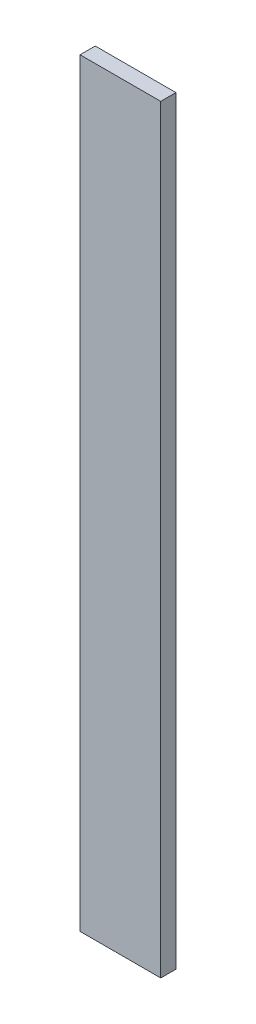
ISO-10303-21;
HEADER;
FILE_DESCRIPTION(('STEP AP214'),'2;1');
FILE_NAME('part.step','',(''),(''),'','','');
FILE_SCHEMA(('AUTOMOTIVE_DESIGN { 1 0 10303 214 1 1 1 1 }'));
ENDSEC;
DATA;
#1=APPLICATION_CONTEXT('core data for automotive mechanical design processes');
#2=APPLICATION_PROTOCOL_DEFINITION('international standard','automotive_design',2000,#1);
#3=PRODUCT_CONTEXT('',#1,'mechanical');
#4=PRODUCT('Part','Part','',(#3));
#5=PRODUCT_RELATED_PRODUCT_CATEGORY('part','',(#4));
#6=PRODUCT_DEFINITION_FORMATION('','',#4);
#7=PRODUCT_DEFINITION_CONTEXT('part definition',#1,'design');
#8=PRODUCT_DEFINITION('design','',#6,#7);
#9=PRODUCT_DEFINITION_SHAPE('','',#8);
#10=(LENGTH_UNIT() NAMED_UNIT(*) SI_UNIT(.MILLI.,.METRE.));
#11=(NAMED_UNIT(*) PLANE_ANGLE_UNIT() SI_UNIT($,.RADIAN.));
#12=(NAMED_UNIT(*) SI_UNIT($,.STERADIAN.) SOLID_ANGLE_UNIT());
#13=UNCERTAINTY_MEASURE_WITH_UNIT(LENGTH_MEASURE(1.E-05),#10,'distance_accuracy_value','');
#14=(GEOMETRIC_REPRESENTATION_CONTEXT(3) GLOBAL_UNCERTAINTY_ASSIGNED_CONTEXT((#13)) GLOBAL_UNIT_ASSIGNED_CONTEXT((#10,
#11,#12)) REPRESENTATION_CONTEXT('',''));
#15=CARTESIAN_POINT('',(0.,0.,0.));
#16=DIRECTION('',(0.,0.,1.));
#17=DIRECTION('',(1.,0.,0.));
#18=AXIS2_PLACEMENT_3D('',#15,#16,#17);
#19=CARTESIAN_POINT('',(184.303499260173,142.200586634191,5.9));
#20=DIRECTION('',(0.,0.,1.));
#21=DIRECTION('',(1.,0.,0.));
#22=AXIS2_PLACEMENT_3D('',#19,#20,#21);
#23=PLANE('',#22);
#24=DIRECTION('',(1.,0.,0.));
#25=VECTOR('',#24,1.);
#26=CARTESIAN_POINT('',(184.303499260173,147.200586634191,5.9));
#27=LINE('',#26,#25);
#28=CARTESIAN_POINT('',(184.834749260173,147.200586634191,5.9));
#29=VERTEX_POINT('',#28);
#30=CARTESIAN_POINT('',(184.303499260173,147.200586634191,5.9));
#31=VERTEX_POINT('',#30);
#32=EDGE_CURVE('E20',#29,#31,#27,.F.);
#33=ORIENTED_EDGE('',*,*,#32,.F.);
#34=DIRECTION('',(0.,1.,0.));
#35=VECTOR('',#34,1.);
#36=CARTESIAN_POINT('',(184.834749260173,142.200586634191,5.9));
#37=LINE('',#36,#35);
#38=CARTESIAN_POINT('',(184.834749260173,142.200586634191,5.9));
#39=VERTEX_POINT('',#38);
#40=EDGE_CURVE('E69',#29,#39,#37,.F.);
#41=ORIENTED_EDGE('',*,*,#40,.T.);
#42=DIRECTION('',(1.,0.,0.));
#43=VECTOR('',#42,1.);
#44=CARTESIAN_POINT('',(184.303499260173,142.200586634191,5.9));
#45=LINE('',#44,#43);
#46=CARTESIAN_POINT('',(184.303499260173,142.200586634191,5.9));
#47=VERTEX_POINT('',#46);
#48=EDGE_CURVE('E56',#39,#47,#45,.F.);
#49=ORIENTED_EDGE('',*,*,#48,.T.);
#50=DIRECTION('',(0.,1.,0.));
#51=VECTOR('',#50,1.);
#52=CARTESIAN_POINT('',(184.303499260173,147.200586634191,5.9));
#53=LINE('',#52,#51);
#54=EDGE_CURVE('E62',#47,#31,#53,.T.);
#55=ORIENTED_EDGE('',*,*,#54,.T.);
#56=EDGE_LOOP('',(#33,#41,#49,#55));
#57=FACE_BOUND('',#56,.T.);
#58=ADVANCED_FACE('F17',(#57),#23,.F.);
#59=CARTESIAN_POINT('',(184.303499260173,147.200586634191,6.));
#60=DIRECTION('',(1.,0.,0.));
#61=DIRECTION('',(0.,0.,-1.));
#62=AXIS2_PLACEMENT_3D('',#59,#60,#61);
#63=PLANE('',#62);
#64=DIRECTION('',(0.,0.,1.));
#65=VECTOR('',#64,1.);
#66=CARTESIAN_POINT('',(184.303499260173,142.200586634191,6.));
#67=LINE('',#66,#65);
#68=CARTESIAN_POINT('',(184.303499260173,142.200586634191,6.));
#69=VERTEX_POINT('',#68);
#70=EDGE_CURVE('E64',#47,#69,#67,.T.);
#71=ORIENTED_EDGE('',*,*,#70,.T.);
#72=DIRECTION('',(0.,1.,0.));
#73=VECTOR('',#72,1.);
#74=CARTESIAN_POINT('',(184.303499260173,142.200586634191,6.));
#75=LINE('',#74,#73);
#76=CARTESIAN_POINT('',(184.303499260173,147.200586634191,6.));
#77=VERTEX_POINT('',#76);
#78=EDGE_CURVE('E83',#77,#69,#75,.F.);
#79=ORIENTED_EDGE('',*,*,#78,.F.);
#80=DIRECTION('',(0.,0.,-1.));
#81=VECTOR('',#80,1.);
#82=CARTESIAN_POINT('',(184.303499260173,147.200586634191,6.));
#83=LINE('',#82,#81);
#84=EDGE_CURVE('E67',#77,#31,#83,.T.);
#85=ORIENTED_EDGE('',*,*,#84,.T.);
#86=ORIENTED_EDGE('',*,*,#54,.F.);
#87=EDGE_LOOP('',(#71,#79,#85,#86));
#88=FACE_BOUND('',#87,.T.);
#89=ADVANCED_FACE('F63',(#88),#63,.F.);
#90=CARTESIAN_POINT('',(184.303499260173,142.200586634191,6.));
#91=DIRECTION('',(0.,1.,0.));
#92=DIRECTION('',(0.,0.,1.));
#93=AXIS2_PLACEMENT_3D('',#90,#91,#92);
#94=PLANE('',#93);
#95=DIRECTION('',(0.,0.,1.));
#96=VECTOR('',#95,1.);
#97=CARTESIAN_POINT('',(184.834749260173,142.200586634191,6.));
#98=LINE('',#97,#96);
#99=CARTESIAN_POINT('',(184.834749260173,142.200586634191,6.));
#100=VERTEX_POINT('',#99);
#101=EDGE_CURVE('E71',#39,#100,#98,.T.);
#102=ORIENTED_EDGE('',*,*,#101,.T.);
#103=DIRECTION('',(1.,0.,0.));
#104=VECTOR('',#103,1.);
#105=CARTESIAN_POINT('',(184.303499260173,142.200586634191,6.));
#106=LINE('',#105,#104);
#107=EDGE_CURVE('E75',#69,#100,#106,.T.);
#108=ORIENTED_EDGE('',*,*,#107,.F.);
#109=ORIENTED_EDGE('',*,*,#70,.F.);
#110=ORIENTED_EDGE('',*,*,#48,.F.);
#111=EDGE_LOOP('',(#102,#108,#109,#110));
#112=FACE_BOUND('',#111,.T.);
#113=ADVANCED_FACE('F73',(#112),#94,.F.);
#114=CARTESIAN_POINT('',(184.834749260173,142.200586634191,6.));
#115=DIRECTION('',(-1.,0.,0.));
#116=DIRECTION('',(0.,0.,1.));
#117=AXIS2_PLACEMENT_3D('',#114,#115,#116);
#118=PLANE('',#117);
#119=DIRECTION('',(0.,0.,-1.));
#120=VECTOR('',#119,1.);
#121=CARTESIAN_POINT('',(184.834749260173,147.200586634191,6.));
#122=LINE('',#121,#120);
#123=CARTESIAN_POINT('',(184.834749260173,147.200586634191,6.));
#124=VERTEX_POINT('',#123);
#125=EDGE_CURVE('E35',#29,#124,#122,.F.);
#126=ORIENTED_EDGE('',*,*,#125,.T.);
#127=DIRECTION('',(0.,1.,0.));
#128=VECTOR('',#127,1.);
#129=CARTESIAN_POINT('',(184.834749260173,142.200586634191,6.));
#130=LINE('',#129,#128);
#131=EDGE_CURVE('E26',#100,#124,#130,.T.);
#132=ORIENTED_EDGE('',*,*,#131,.F.);
#133=ORIENTED_EDGE('',*,*,#101,.F.);
#134=ORIENTED_EDGE('',*,*,#40,.F.);
#135=EDGE_LOOP('',(#126,#132,#133,#134));
#136=FACE_BOUND('',#135,.T.);
#137=ADVANCED_FACE('F89',(#136),#118,.F.);
#138=CARTESIAN_POINT('',(184.834749260173,147.200586634191,6.));
#139=DIRECTION('',(0.,-1.,0.));
#140=DIRECTION('',(0.,0.,-1.));
#141=AXIS2_PLACEMENT_3D('',#138,#139,#140);
#142=PLANE('',#141);
#143=ORIENTED_EDGE('',*,*,#84,.F.);
#144=DIRECTION('',(1.,0.,0.));
#145=VECTOR('',#144,1.);
#146=CARTESIAN_POINT('',(184.303499260173,147.200586634191,6.));
#147=LINE('',#146,#145);
#148=EDGE_CURVE('E11',#124,#77,#147,.F.);
#149=ORIENTED_EDGE('',*,*,#148,.F.);
#150=ORIENTED_EDGE('',*,*,#125,.F.);
#151=ORIENTED_EDGE('',*,*,#32,.T.);
#152=EDGE_LOOP('',(#143,#149,#150,#151));
#153=FACE_BOUND('',#152,.T.);
#154=ADVANCED_FACE('F91',(#153),#142,.F.);
#155=CARTESIAN_POINT('',(184.303499260173,142.200586634191,6.));
#156=DIRECTION('',(0.,0.,1.));
#157=DIRECTION('',(1.,0.,0.));
#158=AXIS2_PLACEMENT_3D('',#155,#156,#157);
#159=PLANE('',#158);
#160=ORIENTED_EDGE('',*,*,#131,.T.);
#161=ORIENTED_EDGE('',*,*,#148,.T.);
#162=ORIENTED_EDGE('',*,*,#78,.T.);
#163=ORIENTED_EDGE('',*,*,#107,.T.);
#164=EDGE_LOOP('',(#160,#161,#162,#163));
#165=FACE_BOUND('',#164,.T.);
#166=ADVANCED_FACE('F88',(#165),#159,.T.);
#167=CLOSED_SHELL('',(#58,#89,#113,#137,#154,#166));
#168=MANIFOLD_SOLID_BREP('B1',#167);
#169=ADVANCED_BREP_SHAPE_REPRESENTATION('',(#18,#168),#14);
#170=SHAPE_DEFINITION_REPRESENTATION(#9,#169);
ENDSEC;
END-ISO-10303-21;
